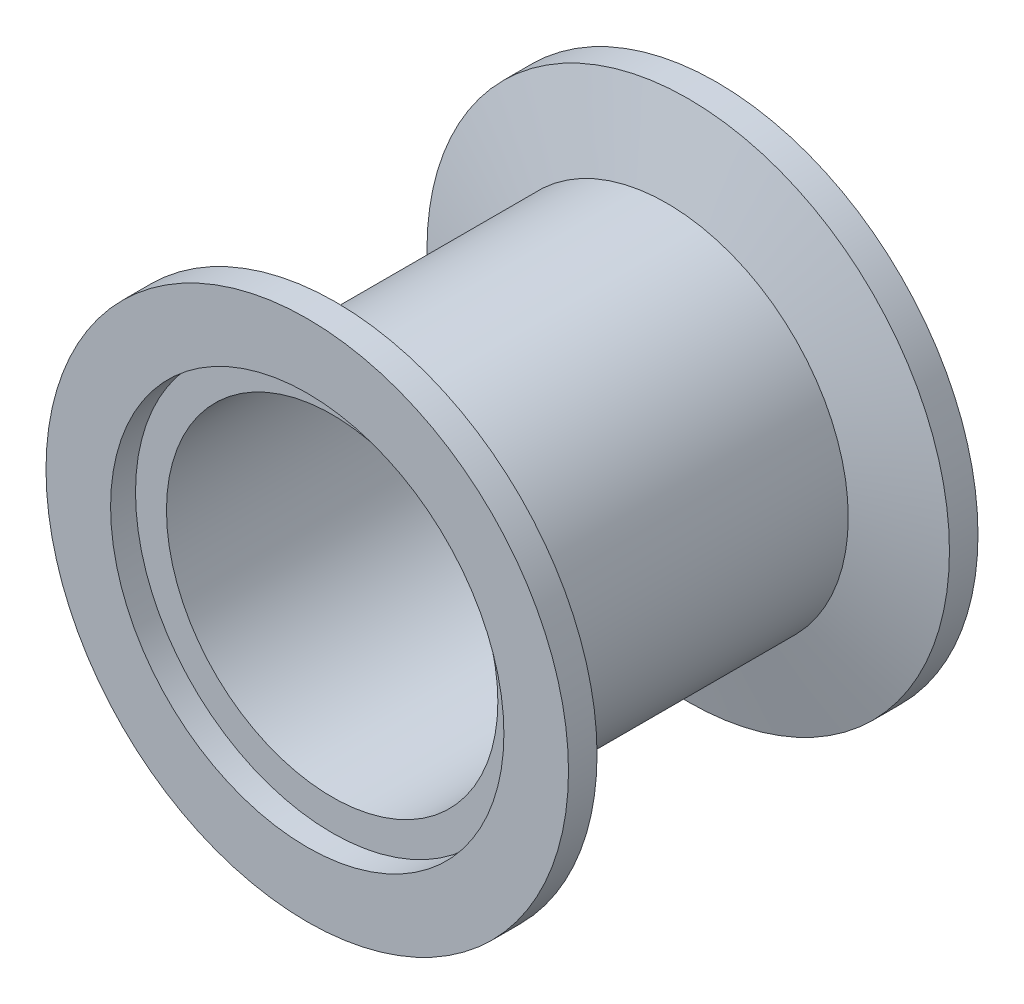
ISO-10303-21;
HEADER;
FILE_DESCRIPTION(('STEP AP214'),'2;1');
FILE_NAME('part.step','',(''),(''),'','','');
FILE_SCHEMA(('AUTOMOTIVE_DESIGN { 1 0 10303 214 1 1 1 1 }'));
ENDSEC;
DATA;
#1=APPLICATION_CONTEXT('core data for automotive mechanical design processes');
#2=APPLICATION_PROTOCOL_DEFINITION('international standard','automotive_design',2000,#1);
#3=PRODUCT_CONTEXT('',#1,'mechanical');
#4=PRODUCT('Part','Part','',(#3));
#5=PRODUCT_RELATED_PRODUCT_CATEGORY('part','',(#4));
#6=PRODUCT_DEFINITION_FORMATION('','',#4);
#7=PRODUCT_DEFINITION_CONTEXT('part definition',#1,'design');
#8=PRODUCT_DEFINITION('design','',#6,#7);
#9=PRODUCT_DEFINITION_SHAPE('','',#8);
#10=(LENGTH_UNIT() NAMED_UNIT(*) SI_UNIT(.MILLI.,.METRE.));
#11=(NAMED_UNIT(*) PLANE_ANGLE_UNIT() SI_UNIT($,.RADIAN.));
#12=(NAMED_UNIT(*) SI_UNIT($,.STERADIAN.) SOLID_ANGLE_UNIT());
#13=UNCERTAINTY_MEASURE_WITH_UNIT(LENGTH_MEASURE(1.E-05),#10,'distance_accuracy_value','');
#14=(GEOMETRIC_REPRESENTATION_CONTEXT(3) GLOBAL_UNCERTAINTY_ASSIGNED_CONTEXT((#13)) GLOBAL_UNIT_ASSIGNED_CONTEXT((#10,
#11,#12)) REPRESENTATION_CONTEXT('',''));
#15=CARTESIAN_POINT('',(0.,0.,0.));
#16=DIRECTION('',(0.,0.,1.));
#17=DIRECTION('',(1.,0.,0.));
#18=AXIS2_PLACEMENT_3D('',#15,#16,#17);
#19=CARTESIAN_POINT('',(0.,0.,21.5));
#20=DIRECTION('',(0.,0.,1.));
#21=DIRECTION('',(1.,0.,0.));
#22=AXIS2_PLACEMENT_3D('',#19,#20,#21);
#23=CYLINDRICAL_SURFACE('',#22,27.432);
#24=CARTESIAN_POINT('',(0.,0.,-18.5028));
#25=DIRECTION('',(0.,0.,1.));
#26=DIRECTION('',(1.,0.,0.));
#27=AXIS2_PLACEMENT_3D('',#24,#25,#26);
#28=CIRCLE('',#27,27.432);
#29=CARTESIAN_POINT('',(27.432,0.,-18.5028));
#30=VERTEX_POINT('',#29);
#31=EDGE_CURVE('E88',#30,#30,#28,.T.);
#32=ORIENTED_EDGE('',*,*,#31,.F.);
#33=EDGE_LOOP('',(#32));
#34=FACE_BOUND('',#33,.T.);
#35=CARTESIAN_POINT('',(0.,0.,-21.5));
#36=DIRECTION('',(0.,0.,1.));
#37=DIRECTION('',(1.,0.,0.));
#38=AXIS2_PLACEMENT_3D('',#35,#36,#37);
#39=CIRCLE('',#38,27.432);
#40=CARTESIAN_POINT('',(27.432,0.,-21.5));
#41=VERTEX_POINT('',#40);
#42=EDGE_CURVE('E10',#41,#41,#39,.T.);
#43=ORIENTED_EDGE('',*,*,#42,.T.);
#44=EDGE_LOOP('',(#43));
#45=FACE_BOUND('',#44,.T.);
#46=ADVANCED_FACE('F37',(#34,#45),#23,.T.);
#47=CARTESIAN_POINT('',(0.,20.6502,-21.5));
#48=DIRECTION('',(0.,0.,1.));
#49=DIRECTION('',(1.,0.,0.));
#50=AXIS2_PLACEMENT_3D('',#47,#48,#49);
#51=PLANE('',#50);
#52=ORIENTED_EDGE('',*,*,#42,.F.);
#53=EDGE_LOOP('',(#52));
#54=FACE_BOUND('',#53,.T.);
#55=CARTESIAN_POINT('',(0.,0.,-21.5));
#56=DIRECTION('',(0.,0.,1.));
#57=DIRECTION('',(1.,0.,0.));
#58=AXIS2_PLACEMENT_3D('',#55,#56,#57);
#59=CIRCLE('',#58,20.6502);
#60=CARTESIAN_POINT('',(20.6502,0.,-21.5));
#61=VERTEX_POINT('',#60);
#62=EDGE_CURVE('E44',#61,#61,#59,.T.);
#63=ORIENTED_EDGE('',*,*,#62,.T.);
#64=EDGE_LOOP('',(#63));
#65=FACE_BOUND('',#64,.T.);
#66=ADVANCED_FACE('F96',(#54,#65),#51,.F.);
#67=CARTESIAN_POINT('',(0.,0.,21.5));
#68=DIRECTION('',(0.,0.,1.));
#69=DIRECTION('',(1.,0.,0.));
#70=AXIS2_PLACEMENT_3D('',#67,#68,#69);
#71=CYLINDRICAL_SURFACE('',#70,20.6502);
#72=ORIENTED_EDGE('',*,*,#62,.F.);
#73=EDGE_LOOP('',(#72));
#74=FACE_BOUND('',#73,.T.);
#75=CARTESIAN_POINT('',(0.,0.,-18.8838));
#76=DIRECTION('',(0.,0.,1.));
#77=DIRECTION('',(1.,0.,0.));
#78=AXIS2_PLACEMENT_3D('',#75,#76,#77);
#79=CIRCLE('',#78,20.6502);
#80=CARTESIAN_POINT('',(20.6502,0.,-18.8838));
#81=VERTEX_POINT('',#80);
#82=EDGE_CURVE('E49',#81,#81,#79,.T.);
#83=ORIENTED_EDGE('',*,*,#82,.T.);
#84=EDGE_LOOP('',(#83));
#85=FACE_BOUND('',#84,.T.);
#86=ADVANCED_FACE('F100',(#74,#85),#71,.F.);
#87=CARTESIAN_POINT('',(0.,17.399,-18.8838));
#88=DIRECTION('',(0.,0.,1.));
#89=DIRECTION('',(1.,0.,0.));
#90=AXIS2_PLACEMENT_3D('',#87,#88,#89);
#91=PLANE('',#90);
#92=ORIENTED_EDGE('',*,*,#82,.F.);
#93=EDGE_LOOP('',(#92));
#94=FACE_BOUND('',#93,.T.);
#95=CARTESIAN_POINT('',(0.,0.,-18.8838));
#96=DIRECTION('',(0.,0.,1.));
#97=DIRECTION('',(1.,0.,0.));
#98=AXIS2_PLACEMENT_3D('',#95,#96,#97);
#99=CIRCLE('',#98,17.399);
#100=CARTESIAN_POINT('',(17.399,0.,-18.8838));
#101=VERTEX_POINT('',#100);
#102=EDGE_CURVE('E54',#101,#101,#99,.T.);
#103=ORIENTED_EDGE('',*,*,#102,.T.);
#104=EDGE_LOOP('',(#103));
#105=FACE_BOUND('',#104,.T.);
#106=ADVANCED_FACE('F105',(#94,#105),#91,.F.);
#107=CARTESIAN_POINT('',(0.,0.,21.5));
#108=DIRECTION('',(0.,0.,1.));
#109=DIRECTION('',(1.,0.,0.));
#110=AXIS2_PLACEMENT_3D('',#107,#108,#109);
#111=CYLINDRICAL_SURFACE('',#110,17.399);
#112=ORIENTED_EDGE('',*,*,#102,.F.);
#113=EDGE_LOOP('',(#112));
#114=FACE_BOUND('',#113,.T.);
#115=CARTESIAN_POINT('',(0.,0.,18.8838));
#116=DIRECTION('',(0.,0.,1.));
#117=DIRECTION('',(1.,0.,0.));
#118=AXIS2_PLACEMENT_3D('',#115,#116,#117);
#119=CIRCLE('',#118,17.399);
#120=CARTESIAN_POINT('',(17.399,0.,18.8838));
#121=VERTEX_POINT('',#120);
#122=EDGE_CURVE('E60',#121,#121,#119,.T.);
#123=ORIENTED_EDGE('',*,*,#122,.T.);
#124=EDGE_LOOP('',(#123));
#125=FACE_BOUND('',#124,.T.);
#126=ADVANCED_FACE('F111',(#114,#125),#111,.F.);
#127=CARTESIAN_POINT('',(0.,20.6502,18.8838));
#128=DIRECTION('',(0.,0.,-1.));
#129=DIRECTION('',(-1.,0.,0.));
#130=AXIS2_PLACEMENT_3D('',#127,#128,#129);
#131=PLANE('',#130);
#132=ORIENTED_EDGE('',*,*,#122,.F.);
#133=EDGE_LOOP('',(#132));
#134=FACE_BOUND('',#133,.T.);
#135=CARTESIAN_POINT('',(0.,0.,18.8838));
#136=DIRECTION('',(0.,0.,1.));
#137=DIRECTION('',(1.,0.,0.));
#138=AXIS2_PLACEMENT_3D('',#135,#136,#137);
#139=CIRCLE('',#138,20.6502);
#140=CARTESIAN_POINT('',(20.6502,0.,18.8838));
#141=VERTEX_POINT('',#140);
#142=EDGE_CURVE('E64',#141,#141,#139,.T.);
#143=ORIENTED_EDGE('',*,*,#142,.T.);
#144=EDGE_LOOP('',(#143));
#145=FACE_BOUND('',#144,.T.);
#146=ADVANCED_FACE('F115',(#134,#145),#131,.F.);
#147=CARTESIAN_POINT('',(0.,0.,21.5));
#148=DIRECTION('',(0.,0.,1.));
#149=DIRECTION('',(1.,0.,0.));
#150=AXIS2_PLACEMENT_3D('',#147,#148,#149);
#151=CYLINDRICAL_SURFACE('',#150,20.6502);
#152=ORIENTED_EDGE('',*,*,#142,.F.);
#153=EDGE_LOOP('',(#152));
#154=FACE_BOUND('',#153,.T.);
#155=CARTESIAN_POINT('',(0.,0.,21.5));
#156=DIRECTION('',(0.,0.,1.));
#157=DIRECTION('',(1.,0.,0.));
#158=AXIS2_PLACEMENT_3D('',#155,#156,#157);
#159=CIRCLE('',#158,20.6502);
#160=CARTESIAN_POINT('',(20.6502,0.,21.5));
#161=VERTEX_POINT('',#160);
#162=EDGE_CURVE('E68',#161,#161,#159,.T.);
#163=ORIENTED_EDGE('',*,*,#162,.T.);
#164=EDGE_LOOP('',(#163));
#165=FACE_BOUND('',#164,.T.);
#166=ADVANCED_FACE('F119',(#154,#165),#151,.F.);
#167=CARTESIAN_POINT('',(0.,20.6502,21.5));
#168=DIRECTION('',(0.,0.,-1.));
#169=DIRECTION('',(-1.,0.,0.));
#170=AXIS2_PLACEMENT_3D('',#167,#168,#169);
#171=PLANE('',#170);
#172=ORIENTED_EDGE('',*,*,#162,.F.);
#173=EDGE_LOOP('',(#172));
#174=FACE_BOUND('',#173,.T.);
#175=CARTESIAN_POINT('',(0.,0.,21.5));
#176=DIRECTION('',(0.,0.,1.));
#177=DIRECTION('',(1.,0.,0.));
#178=AXIS2_PLACEMENT_3D('',#175,#176,#177);
#179=CIRCLE('',#178,27.432);
#180=CARTESIAN_POINT('',(27.432,0.,21.5));
#181=VERTEX_POINT('',#180);
#182=EDGE_CURVE('E72',#181,#181,#179,.T.);
#183=ORIENTED_EDGE('',*,*,#182,.T.);
#184=EDGE_LOOP('',(#183));
#185=FACE_BOUND('',#184,.T.);
#186=ADVANCED_FACE('F123',(#174,#185),#171,.F.);
#187=CARTESIAN_POINT('',(0.,0.,21.5));
#188=DIRECTION('',(0.,0.,1.));
#189=DIRECTION('',(1.,0.,0.));
#190=AXIS2_PLACEMENT_3D('',#187,#188,#189);
#191=CYLINDRICAL_SURFACE('',#190,27.432);
#192=ORIENTED_EDGE('',*,*,#182,.F.);
#193=EDGE_LOOP('',(#192));
#194=FACE_BOUND('',#193,.T.);
#195=CARTESIAN_POINT('',(0.,0.,18.5028));
#196=DIRECTION('',(0.,0.,1.));
#197=DIRECTION('',(1.,0.,0.));
#198=AXIS2_PLACEMENT_3D('',#195,#196,#197);
#199=CIRCLE('',#198,27.432);
#200=CARTESIAN_POINT('',(27.432,0.,18.5028));
#201=VERTEX_POINT('',#200);
#202=EDGE_CURVE('E76',#201,#201,#199,.T.);
#203=ORIENTED_EDGE('',*,*,#202,.T.);
#204=EDGE_LOOP('',(#203));
#205=FACE_BOUND('',#204,.T.);
#206=ADVANCED_FACE('F127',(#194,#205),#191,.T.);
#207=CARTESIAN_POINT('',(0.,0.,16.2568498690424));
#208=DIRECTION('',(0.,0.,1.));
#209=DIRECTION('',(1.,0.,0.));
#210=AXIS2_PLACEMENT_3D('',#207,#208,#209);
#211=CONICAL_SURFACE('',#210,19.05,1.30899693899575);
#212=ORIENTED_EDGE('',*,*,#202,.F.);
#213=EDGE_LOOP('',(#212));
#214=FACE_BOUND('',#213,.T.);
#215=CARTESIAN_POINT('',(0.,0.,16.2568498690424));
#216=DIRECTION('',(0.,0.,1.));
#217=DIRECTION('',(1.,0.,0.));
#218=AXIS2_PLACEMENT_3D('',#215,#216,#217);
#219=CIRCLE('',#218,19.05);
#220=CARTESIAN_POINT('',(19.05,0.,16.2568498690424));
#221=VERTEX_POINT('',#220);
#222=EDGE_CURVE('E80',#221,#221,#219,.T.);
#223=ORIENTED_EDGE('',*,*,#222,.T.);
#224=EDGE_LOOP('',(#223));
#225=FACE_BOUND('',#224,.T.);
#226=ADVANCED_FACE('F131',(#214,#225),#211,.T.);
#227=CARTESIAN_POINT('',(0.,0.,21.5));
#228=DIRECTION('',(0.,0.,1.));
#229=DIRECTION('',(1.,0.,0.));
#230=AXIS2_PLACEMENT_3D('',#227,#228,#229);
#231=CYLINDRICAL_SURFACE('',#230,19.05);
#232=ORIENTED_EDGE('',*,*,#222,.F.);
#233=EDGE_LOOP('',(#232));
#234=FACE_BOUND('',#233,.T.);
#235=CARTESIAN_POINT('',(0.,0.,-16.2568498690424));
#236=DIRECTION('',(0.,0.,1.));
#237=DIRECTION('',(1.,0.,0.));
#238=AXIS2_PLACEMENT_3D('',#235,#236,#237);
#239=CIRCLE('',#238,19.05);
#240=CARTESIAN_POINT('',(19.05,0.,-16.2568498690424));
#241=VERTEX_POINT('',#240);
#242=EDGE_CURVE('E84',#241,#241,#239,.T.);
#243=ORIENTED_EDGE('',*,*,#242,.T.);
#244=EDGE_LOOP('',(#243));
#245=FACE_BOUND('',#244,.T.);
#246=ADVANCED_FACE('F135',(#234,#245),#231,.T.);
#247=CARTESIAN_POINT('',(0.,0.,-18.5028));
#248=DIRECTION('',(0.,0.,-1.));
#249=DIRECTION('',(-1.,0.,0.));
#250=AXIS2_PLACEMENT_3D('',#247,#248,#249);
#251=CONICAL_SURFACE('',#250,27.432,1.30899693899575);
#252=ORIENTED_EDGE('',*,*,#242,.F.);
#253=EDGE_LOOP('',(#252));
#254=FACE_BOUND('',#253,.T.);
#255=ORIENTED_EDGE('',*,*,#31,.T.);
#256=EDGE_LOOP('',(#255));
#257=FACE_BOUND('',#256,.T.);
#258=ADVANCED_FACE('F93',(#254,#257),#251,.T.);
#259=CLOSED_SHELL('',(#46,#66,#86,#106,#126,#146,#166,#186,#206,#226,#246,#258));
#260=MANIFOLD_SOLID_BREP('B2',#259);
#261=ADVANCED_BREP_SHAPE_REPRESENTATION('',(#18,#260),#14);
#262=SHAPE_DEFINITION_REPRESENTATION(#9,#261);
ENDSEC;
END-ISO-10303-21;
